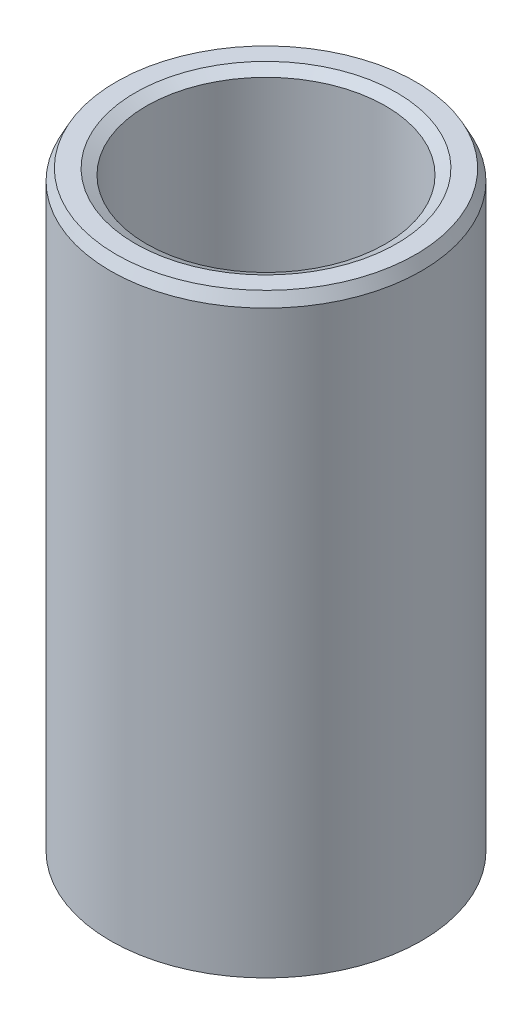
ISO-10303-21;
HEADER;
FILE_DESCRIPTION(('STEP AP214'),'2;1');
FILE_NAME('part.step','',(''),(''),'','','');
FILE_SCHEMA(('AUTOMOTIVE_DESIGN { 1 0 10303 214 1 1 1 1 }'));
ENDSEC;
DATA;
#1=APPLICATION_CONTEXT('core data for automotive mechanical design processes');
#2=APPLICATION_PROTOCOL_DEFINITION('international standard','automotive_design',2000,#1);
#3=PRODUCT_CONTEXT('',#1,'mechanical');
#4=PRODUCT('Part','Part','',(#3));
#5=PRODUCT_RELATED_PRODUCT_CATEGORY('part','',(#4));
#6=PRODUCT_DEFINITION_FORMATION('','',#4);
#7=PRODUCT_DEFINITION_CONTEXT('part definition',#1,'design');
#8=PRODUCT_DEFINITION('design','',#6,#7);
#9=PRODUCT_DEFINITION_SHAPE('','',#8);
#10=(LENGTH_UNIT() NAMED_UNIT(*) SI_UNIT(.MILLI.,.METRE.));
#11=(NAMED_UNIT(*) PLANE_ANGLE_UNIT() SI_UNIT($,.RADIAN.));
#12=(NAMED_UNIT(*) SI_UNIT($,.STERADIAN.) SOLID_ANGLE_UNIT());
#13=UNCERTAINTY_MEASURE_WITH_UNIT(LENGTH_MEASURE(1.E-05),#10,'distance_accuracy_value','');
#14=(GEOMETRIC_REPRESENTATION_CONTEXT(3) GLOBAL_UNCERTAINTY_ASSIGNED_CONTEXT((#13)) GLOBAL_UNIT_ASSIGNED_CONTEXT((#10,
#11,#12)) REPRESENTATION_CONTEXT('',''));
#15=CARTESIAN_POINT('',(0.,0.,0.));
#16=DIRECTION('',(0.,0.,1.));
#17=DIRECTION('',(1.,0.,0.));
#18=AXIS2_PLACEMENT_3D('',#15,#16,#17);
#19=CARTESIAN_POINT('',(0.,95.9867309816604,0.));
#20=DIRECTION('',(0.,-1.,0.));
#21=DIRECTION('',(0.,0.,-1.));
#22=AXIS2_PLACEMENT_3D('',#19,#20,#21);
#23=CYLINDRICAL_SURFACE('',#22,25.);
#24=CARTESIAN_POINT('',(0.,0.942688678001971,0.));
#25=DIRECTION('',(0.,1.,0.));
#26=DIRECTION('',(0.,0.,1.));
#27=AXIS2_PLACEMENT_3D('',#24,#25,#26);
#28=CIRCLE('',#27,25.);
#29=CARTESIAN_POINT('',(0.,0.942688678001971,25.));
#30=VERTEX_POINT('',#29);
#31=EDGE_CURVE('E10',#30,#30,#28,.T.);
#32=ORIENTED_EDGE('',*,*,#31,.T.);
#33=EDGE_LOOP('',(#32));
#34=FACE_BOUND('',#33,.T.);
#35=CARTESIAN_POINT('',(0.,94.177527816436,0.));
#36=DIRECTION('',(0.,1.,0.));
#37=DIRECTION('',(0.,0.,1.));
#38=AXIS2_PLACEMENT_3D('',#35,#36,#37);
#39=CIRCLE('',#38,25.);
#40=CARTESIAN_POINT('',(0.,94.177527816436,25.));
#41=VERTEX_POINT('',#40);
#42=EDGE_CURVE('E50',#41,#41,#39,.F.);
#43=ORIENTED_EDGE('',*,*,#42,.T.);
#44=EDGE_LOOP('',(#43));
#45=FACE_BOUND('',#44,.T.);
#46=ADVANCED_FACE('F39',(#34,#45),#23,.T.);
#47=CARTESIAN_POINT('',(0.,95.9867309816604,0.));
#48=DIRECTION('',(0.,1.,0.));
#49=DIRECTION('',(0.,0.,1.));
#50=AXIS2_PLACEMENT_3D('',#47,#48,#49);
#51=PLANE('',#50);
#52=CARTESIAN_POINT('',(0.,95.9867309816604,0.));
#53=DIRECTION('',(0.,1.,0.));
#54=DIRECTION('',(0.,0.,1.));
#55=AXIS2_PLACEMENT_3D('',#52,#53,#54);
#56=CIRCLE('',#55,21.0212137447185);
#57=CARTESIAN_POINT('',(0.,95.9867309816604,21.0212137447185));
#58=VERTEX_POINT('',#57);
#59=EDGE_CURVE('E58',#58,#58,#56,.F.);
#60=ORIENTED_EDGE('',*,*,#59,.T.);
#61=EDGE_LOOP('',(#60));
#62=FACE_BOUND('',#61,.T.);
#63=CARTESIAN_POINT('',(0.,95.9867309816604,0.));
#64=DIRECTION('',(0.,1.,0.));
#65=DIRECTION('',(0.,0.,1.));
#66=AXIS2_PLACEMENT_3D('',#63,#64,#65);
#67=CIRCLE('',#66,24.057311321998);
#68=CARTESIAN_POINT('',(0.,95.9867309816604,24.057311321998));
#69=VERTEX_POINT('',#68);
#70=EDGE_CURVE('E61',#69,#69,#67,.T.);
#71=ORIENTED_EDGE('',*,*,#70,.T.);
#72=EDGE_LOOP('',(#71));
#73=FACE_BOUND('',#72,.T.);
#74=ADVANCED_FACE('F88',(#62,#73),#51,.T.);
#75=CARTESIAN_POINT('',(0.,0.,0.));
#76=DIRECTION('',(0.,1.,0.));
#77=DIRECTION('',(0.,0.,1.));
#78=AXIS2_PLACEMENT_3D('',#75,#76,#77);
#79=PLANE('',#78);
#80=CARTESIAN_POINT('',(0.,0.,0.));
#81=DIRECTION('',(0.,1.,0.));
#82=DIRECTION('',(0.,0.,1.));
#83=AXIS2_PLACEMENT_3D('',#80,#81,#82);
#84=CIRCLE('',#83,20.1546992574961);
#85=CARTESIAN_POINT('',(0.,0.,20.1546992574961));
#86=VERTEX_POINT('',#85);
#87=EDGE_CURVE('E51',#86,#86,#84,.T.);
#88=ORIENTED_EDGE('',*,*,#87,.T.);
#89=EDGE_LOOP('',(#88));
#90=FACE_BOUND('',#89,.T.);
#91=CARTESIAN_POINT('',(0.,0.,0.));
#92=DIRECTION('',(0.,1.,0.));
#93=DIRECTION('',(0.,0.,1.));
#94=AXIS2_PLACEMENT_3D('',#91,#92,#93);
#95=CIRCLE('',#94,23.1907968347757);
#96=CARTESIAN_POINT('',(0.,0.,23.1907968347757));
#97=VERTEX_POINT('',#96);
#98=EDGE_CURVE('E54',#97,#97,#95,.F.);
#99=ORIENTED_EDGE('',*,*,#98,.T.);
#100=EDGE_LOOP('',(#99));
#101=FACE_BOUND('',#100,.T.);
#102=ADVANCED_FACE('F83',(#90,#101),#79,.F.);
#103=CARTESIAN_POINT('',(0.,95.9867309816604,0.));
#104=DIRECTION('',(0.,-1.,0.));
#105=DIRECTION('',(0.,0.,-1.));
#106=AXIS2_PLACEMENT_3D('',#103,#104,#105);
#107=CYLINDRICAL_SURFACE('',#106,19.2120105794942);
#108=CARTESIAN_POINT('',(0.,95.0440423036584,0.));
#109=DIRECTION('',(0.,1.,0.));
#110=DIRECTION('',(0.,0.,1.));
#111=AXIS2_PLACEMENT_3D('',#108,#109,#110);
#112=CIRCLE('',#111,19.2120105794942);
#113=CARTESIAN_POINT('',(0.,95.0440423036584,19.2120105794942));
#114=VERTEX_POINT('',#113);
#115=EDGE_CURVE('E67',#114,#114,#112,.T.);
#116=ORIENTED_EDGE('',*,*,#115,.T.);
#117=EDGE_LOOP('',(#116));
#118=FACE_BOUND('',#117,.T.);
#119=CARTESIAN_POINT('',(0.,1.80920316522434,0.));
#120=DIRECTION('',(0.,1.,0.));
#121=DIRECTION('',(0.,0.,1.));
#122=AXIS2_PLACEMENT_3D('',#119,#120,#121);
#123=CIRCLE('',#122,19.2120105794942);
#124=CARTESIAN_POINT('',(0.,1.80920316522434,19.2120105794942));
#125=VERTEX_POINT('',#124);
#126=EDGE_CURVE('E69',#125,#125,#123,.F.);
#127=ORIENTED_EDGE('',*,*,#126,.T.);
#128=EDGE_LOOP('',(#127));
#129=FACE_BOUND('',#128,.T.);
#130=ADVANCED_FACE('F71',(#118,#129),#107,.F.);
#131=CARTESIAN_POINT('',(0.,95.0440423036584,0.));
#132=DIRECTION('',(0.,1.,0.));
#133=DIRECTION('',(0.,0.,1.));
#134=AXIS2_PLACEMENT_3D('',#131,#132,#133);
#135=CONICAL_SURFACE('',#134,19.2120105794942,1.09044941429551);
#136=ORIENTED_EDGE('',*,*,#59,.F.);
#137=EDGE_LOOP('',(#136));
#138=FACE_BOUND('',#137,.T.);
#139=ORIENTED_EDGE('',*,*,#115,.F.);
#140=EDGE_LOOP('',(#139));
#141=FACE_BOUND('',#140,.T.);
#142=ADVANCED_FACE('F77',(#138,#141),#135,.F.);
#143=CARTESIAN_POINT('',(0.,0.,0.));
#144=DIRECTION('',(0.,-1.,0.));
#145=DIRECTION('',(0.,0.,-1.));
#146=AXIS2_PLACEMENT_3D('',#143,#144,#145);
#147=CONICAL_SURFACE('',#146,20.1546992574961,0.480346912499381);
#148=ORIENTED_EDGE('',*,*,#126,.F.);
#149=EDGE_LOOP('',(#148));
#150=FACE_BOUND('',#149,.T.);
#151=ORIENTED_EDGE('',*,*,#87,.F.);
#152=EDGE_LOOP('',(#151));
#153=FACE_BOUND('',#152,.T.);
#154=ADVANCED_FACE('F73',(#150,#153),#147,.F.);
#155=CARTESIAN_POINT('',(0.,0.942688678001971,0.));
#156=DIRECTION('',(0.,1.,0.));
#157=DIRECTION('',(0.,0.,1.));
#158=AXIS2_PLACEMENT_3D('',#155,#156,#157);
#159=CONICAL_SURFACE('',#158,25.,1.09044941429552);
#160=ORIENTED_EDGE('',*,*,#98,.F.);
#161=EDGE_LOOP('',(#160));
#162=FACE_BOUND('',#161,.T.);
#163=ORIENTED_EDGE('',*,*,#31,.F.);
#164=EDGE_LOOP('',(#163));
#165=FACE_BOUND('',#164,.T.);
#166=ADVANCED_FACE('F76',(#162,#165),#159,.T.);
#167=CARTESIAN_POINT('',(0.,95.9867309816604,0.));
#168=DIRECTION('',(0.,-1.,0.));
#169=DIRECTION('',(0.,0.,-1.));
#170=AXIS2_PLACEMENT_3D('',#167,#168,#169);
#171=CONICAL_SURFACE('',#170,24.057311321998,0.48034691249938);
#172=ORIENTED_EDGE('',*,*,#42,.F.);
#173=EDGE_LOOP('',(#172));
#174=FACE_BOUND('',#173,.T.);
#175=ORIENTED_EDGE('',*,*,#70,.F.);
#176=EDGE_LOOP('',(#175));
#177=FACE_BOUND('',#176,.T.);
#178=ADVANCED_FACE('F45',(#174,#177),#171,.T.);
#179=CLOSED_SHELL('',(#46,#74,#102,#130,#142,#154,#166,#178));
#180=MANIFOLD_SOLID_BREP('B2',#179);
#181=ADVANCED_BREP_SHAPE_REPRESENTATION('',(#18,#180),#14);
#182=SHAPE_DEFINITION_REPRESENTATION(#9,#181);
ENDSEC;
END-ISO-10303-21;
